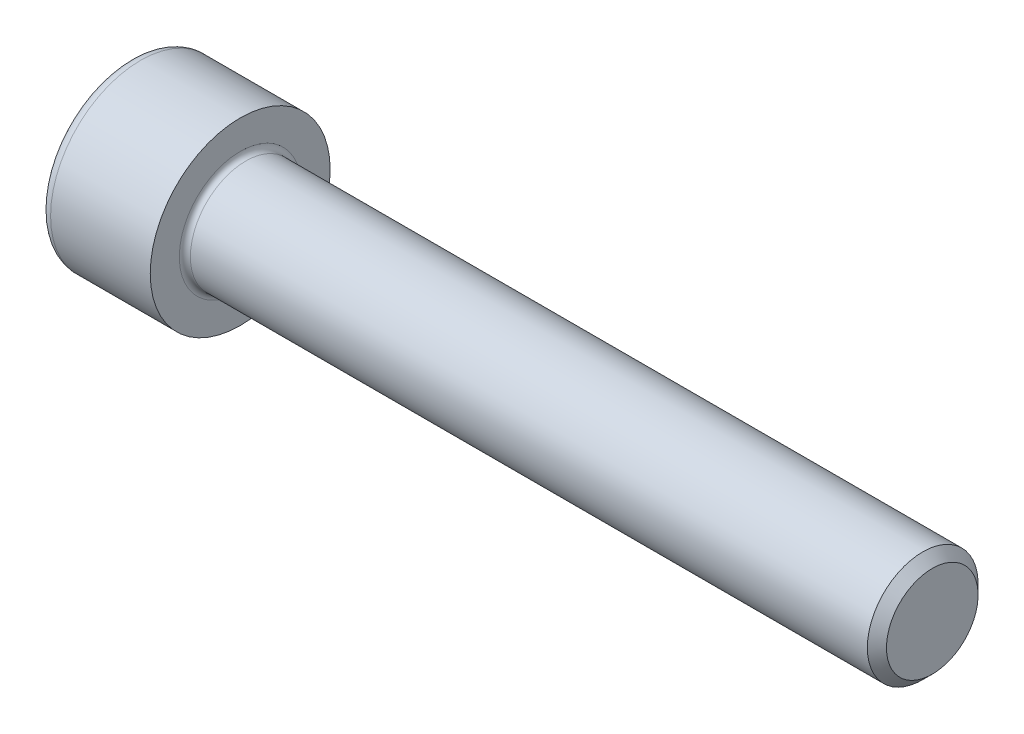
ISO-10303-21;
HEADER;
FILE_DESCRIPTION(('STEP AP214'),'2;1');
FILE_NAME('part.step','',(''),(''),'','','');
FILE_SCHEMA(('AUTOMOTIVE_DESIGN { 1 0 10303 214 1 1 1 1 }'));
ENDSEC;
DATA;
#1=APPLICATION_CONTEXT('core data for automotive mechanical design processes');
#2=APPLICATION_PROTOCOL_DEFINITION('international standard','automotive_design',2000,#1);
#3=PRODUCT_CONTEXT('',#1,'mechanical');
#4=PRODUCT('Part','Part','',(#3));
#5=PRODUCT_RELATED_PRODUCT_CATEGORY('part','',(#4));
#6=PRODUCT_DEFINITION_FORMATION('','',#4);
#7=PRODUCT_DEFINITION_CONTEXT('part definition',#1,'design');
#8=PRODUCT_DEFINITION('design','',#6,#7);
#9=PRODUCT_DEFINITION_SHAPE('','',#8);
#10=(LENGTH_UNIT() NAMED_UNIT(*) SI_UNIT(.MILLI.,.METRE.));
#11=(NAMED_UNIT(*) PLANE_ANGLE_UNIT() SI_UNIT($,.RADIAN.));
#12=(NAMED_UNIT(*) SI_UNIT($,.STERADIAN.) SOLID_ANGLE_UNIT());
#13=UNCERTAINTY_MEASURE_WITH_UNIT(LENGTH_MEASURE(1.E-05),#10,'distance_accuracy_value','');
#14=(GEOMETRIC_REPRESENTATION_CONTEXT(3) GLOBAL_UNCERTAINTY_ASSIGNED_CONTEXT((#13)) GLOBAL_UNIT_ASSIGNED_CONTEXT((#10,
#11,#12)) REPRESENTATION_CONTEXT('',''));
#15=CARTESIAN_POINT('',(0.,0.,0.));
#16=DIRECTION('',(0.,0.,1.));
#17=DIRECTION('',(1.,0.,0.));
#18=AXIS2_PLACEMENT_3D('',#15,#16,#17);
#19=CARTESIAN_POINT('',(0.,0.,0.));
#20=DIRECTION('',(-1.,0.,0.));
#21=DIRECTION('',(0.,0.,1.));
#22=AXIS2_PLACEMENT_3D('',#19,#20,#21);
#23=PLANE('',#22);
#24=DIRECTION('',(0.,-0.499999999999999,0.866025403784439));
#25=VECTOR('',#24,1.);
#26=CARTESIAN_POINT('',(0.,3.47564862052154,0.));
#27=LINE('',#26,#25);
#28=CARTESIAN_POINT('',(0.,3.47564862052154,0.));
#29=VERTEX_POINT('',#28);
#30=CARTESIAN_POINT('',(0.,1.73782431026077,3.01));
#31=VERTEX_POINT('',#30);
#32=EDGE_CURVE('E259',#29,#31,#27,.T.);
#33=ORIENTED_EDGE('',*,*,#32,.T.);
#34=DIRECTION('',(0.,1.,0.));
#35=VECTOR('',#34,1.);
#36=CARTESIAN_POINT('',(0.,-1.73782431026077,3.01));
#37=LINE('',#36,#35);
#38=CARTESIAN_POINT('',(0.,-1.73782431026077,3.01));
#39=VERTEX_POINT('',#38);
#40=EDGE_CURVE('E131',#39,#31,#37,.T.);
#41=ORIENTED_EDGE('',*,*,#40,.F.);
#42=DIRECTION('',(0.,-0.500000000000001,-0.866025403784438));
#43=VECTOR('',#42,1.);
#44=CARTESIAN_POINT('',(0.,-1.73782431026077,3.01));
#45=LINE('',#44,#43);
#46=CARTESIAN_POINT('',(0.,-3.47564862052155,0.));
#47=VERTEX_POINT('',#46);
#48=EDGE_CURVE('E262',#39,#47,#45,.T.);
#49=ORIENTED_EDGE('',*,*,#48,.T.);
#50=DIRECTION('',(0.,0.499999999999999,-0.866025403784439));
#51=VECTOR('',#50,1.);
#52=CARTESIAN_POINT('',(0.,-3.47564862052155,0.));
#53=LINE('',#52,#51);
#54=CARTESIAN_POINT('',(0.,-1.73782431026078,-3.01));
#55=VERTEX_POINT('',#54);
#56=EDGE_CURVE('E265',#47,#55,#53,.T.);
#57=ORIENTED_EDGE('',*,*,#56,.T.);
#58=DIRECTION('',(0.,-1.,0.));
#59=VECTOR('',#58,1.);
#60=CARTESIAN_POINT('',(0.,1.73782431026076,-3.01));
#61=LINE('',#60,#59);
#62=CARTESIAN_POINT('',(0.,1.73782431026076,-3.01));
#63=VERTEX_POINT('',#62);
#64=EDGE_CURVE('E268',#63,#55,#61,.T.);
#65=ORIENTED_EDGE('',*,*,#64,.F.);
#66=DIRECTION('',(0.,-0.500000000000001,-0.866025403784438));
#67=VECTOR('',#66,1.);
#68=CARTESIAN_POINT('',(0.,3.47564862052154,0.));
#69=LINE('',#68,#67);
#70=EDGE_CURVE('E126',#29,#63,#69,.T.);
#71=ORIENTED_EDGE('',*,*,#70,.F.);
#72=EDGE_LOOP('',(#33,#41,#49,#57,#65,#71));
#73=FACE_BOUND('',#72,.T.);
#74=CARTESIAN_POINT('',(0.,0.,0.));
#75=DIRECTION('',(-1.,0.,0.));
#76=DIRECTION('',(0.,0.,1.));
#77=AXIS2_PLACEMENT_3D('',#74,#75,#76);
#78=CIRCLE('',#77,5.7);
#79=CARTESIAN_POINT('',(0.,0.,5.7));
#80=VERTEX_POINT('',#79);
#81=EDGE_CURVE('E43',#80,#80,#78,.T.);
#82=ORIENTED_EDGE('',*,*,#81,.T.);
#83=EDGE_LOOP('',(#82));
#84=FACE_BOUND('',#83,.T.);
#85=ADVANCED_FACE('F35',(#73,#84),#23,.T.);
#86=CARTESIAN_POINT('',(-31.75,0.,0.));
#87=DIRECTION('',(-1.,0.,0.));
#88=DIRECTION('',(0.,0.,1.));
#89=AXIS2_PLACEMENT_3D('',#86,#87,#88);
#90=CYLINDRICAL_SURFACE('',#89,6.5);
#91=CARTESIAN_POINT('',(0.800000000000002,0.,0.));
#92=DIRECTION('',(-1.,0.,0.));
#93=DIRECTION('',(0.,0.,1.));
#94=AXIS2_PLACEMENT_3D('',#91,#92,#93);
#95=CIRCLE('',#94,6.5);
#96=CARTESIAN_POINT('',(0.800000000000002,0.,6.5));
#97=VERTEX_POINT('',#96);
#98=EDGE_CURVE('E11',#97,#97,#95,.F.);
#99=ORIENTED_EDGE('',*,*,#98,.T.);
#100=EDGE_LOOP('',(#99));
#101=FACE_BOUND('',#100,.T.);
#102=CARTESIAN_POINT('',(8.,0.,0.));
#103=DIRECTION('',(-1.,0.,0.));
#104=DIRECTION('',(0.,0.,1.));
#105=AXIS2_PLACEMENT_3D('',#102,#103,#104);
#106=CIRCLE('',#105,6.5);
#107=CARTESIAN_POINT('',(8.,0.,6.5));
#108=VERTEX_POINT('',#107);
#109=EDGE_CURVE('E149',#108,#108,#106,.T.);
#110=ORIENTED_EDGE('',*,*,#109,.T.);
#111=EDGE_LOOP('',(#110));
#112=FACE_BOUND('',#111,.T.);
#113=ADVANCED_FACE('F173',(#101,#112),#90,.T.);
#114=CARTESIAN_POINT('',(8.,6.5,0.));
#115=DIRECTION('',(1.,0.,0.));
#116=DIRECTION('',(0.,0.,-1.));
#117=AXIS2_PLACEMENT_3D('',#114,#115,#116);
#118=PLANE('',#117);
#119=CARTESIAN_POINT('',(8.,0.,0.));
#120=DIRECTION('',(1.,0.,0.));
#121=DIRECTION('',(0.,0.,-1.));
#122=AXIS2_PLACEMENT_3D('',#119,#120,#121);
#123=CIRCLE('',#122,4.39999999999999);
#124=CARTESIAN_POINT('',(8.,0.,-4.39999999999999));
#125=VERTEX_POINT('',#124);
#126=EDGE_CURVE('E152',#125,#125,#123,.F.);
#127=ORIENTED_EDGE('',*,*,#126,.T.);
#128=EDGE_LOOP('',(#127));
#129=FACE_BOUND('',#128,.T.);
#130=ORIENTED_EDGE('',*,*,#109,.F.);
#131=EDGE_LOOP('',(#130));
#132=FACE_BOUND('',#131,.T.);
#133=ADVANCED_FACE('F179',(#129,#132),#118,.T.);
#134=CARTESIAN_POINT('',(-31.75,0.,0.));
#135=DIRECTION('',(-1.,0.,0.));
#136=DIRECTION('',(0.,0.,1.));
#137=AXIS2_PLACEMENT_3D('',#134,#135,#136);
#138=CYLINDRICAL_SURFACE('',#137,3.99999999999999);
#139=CARTESIAN_POINT('',(8.4,0.,0.));
#140=DIRECTION('',(1.,0.,0.));
#141=DIRECTION('',(0.,0.,-1.));
#142=AXIS2_PLACEMENT_3D('',#139,#140,#141);
#143=CIRCLE('',#142,3.99999999999999);
#144=CARTESIAN_POINT('',(8.4,0.,-3.99999999999999));
#145=VERTEX_POINT('',#144);
#146=EDGE_CURVE('E155',#145,#145,#143,.T.);
#147=ORIENTED_EDGE('',*,*,#146,.T.);
#148=EDGE_LOOP('',(#147));
#149=FACE_BOUND('',#148,.T.);
#150=CARTESIAN_POINT('',(57.3095,0.,0.));
#151=DIRECTION('',(-1.,0.,0.));
#152=DIRECTION('',(0.,0.,1.));
#153=AXIS2_PLACEMENT_3D('',#150,#151,#152);
#154=CIRCLE('',#153,3.99999999999998);
#155=CARTESIAN_POINT('',(57.3095,0.,3.99999999999998));
#156=VERTEX_POINT('',#155);
#157=EDGE_CURVE('E146',#156,#156,#154,.T.);
#158=ORIENTED_EDGE('',*,*,#157,.T.);
#159=EDGE_LOOP('',(#158));
#160=FACE_BOUND('',#159,.T.);
#161=ADVANCED_FACE('F185',(#149,#160),#138,.T.);
#162=CARTESIAN_POINT('',(58.,0.,0.));
#163=DIRECTION('',(-1.,0.,0.));
#164=DIRECTION('',(0.,0.,1.));
#165=AXIS2_PLACEMENT_3D('',#162,#163,#164);
#166=CONICAL_SURFACE('',#165,3.3095,0.785398163397423);
#167=ORIENTED_EDGE('',*,*,#157,.F.);
#168=EDGE_LOOP('',(#167));
#169=FACE_BOUND('',#168,.T.);
#170=CARTESIAN_POINT('',(58.,0.,0.));
#171=DIRECTION('',(-1.,0.,0.));
#172=DIRECTION('',(0.,0.,1.));
#173=AXIS2_PLACEMENT_3D('',#170,#171,#172);
#174=CIRCLE('',#173,3.3095);
#175=CARTESIAN_POINT('',(58.,0.,3.3095));
#176=VERTEX_POINT('',#175);
#177=EDGE_CURVE('E142',#176,#176,#174,.T.);
#178=ORIENTED_EDGE('',*,*,#177,.T.);
#179=EDGE_LOOP('',(#178));
#180=FACE_BOUND('',#179,.T.);
#181=ADVANCED_FACE('F189',(#169,#180),#166,.T.);
#182=CARTESIAN_POINT('',(58.,3.3095,0.));
#183=DIRECTION('',(1.,0.,0.));
#184=DIRECTION('',(0.,0.,-1.));
#185=AXIS2_PLACEMENT_3D('',#182,#183,#184);
#186=PLANE('',#185);
#187=ORIENTED_EDGE('',*,*,#177,.F.);
#188=EDGE_LOOP('',(#187));
#189=FACE_BOUND('',#188,.T.);
#190=ADVANCED_FACE('F169',(#189),#186,.T.);
#191=CARTESIAN_POINT('',(8.4,0.,0.));
#192=DIRECTION('',(1.,0.,0.));
#193=DIRECTION('',(0.,0.,-1.));
#194=AXIS2_PLACEMENT_3D('',#191,#192,#193);
#195=TOROIDAL_SURFACE('',#194,4.39999999999999,0.4);
#196=ORIENTED_EDGE('',*,*,#146,.F.);
#197=EDGE_LOOP('',(#196));
#198=FACE_BOUND('',#197,.T.);
#199=ORIENTED_EDGE('',*,*,#126,.F.);
#200=EDGE_LOOP('',(#199));
#201=FACE_BOUND('',#200,.T.);
#202=ADVANCED_FACE('F162',(#198,#201),#195,.F.);
#203=CARTESIAN_POINT('',(0.800000000000002,0.,0.));
#204=DIRECTION('',(-1.,0.,0.));
#205=DIRECTION('',(0.,0.,1.));
#206=AXIS2_PLACEMENT_3D('',#203,#204,#205);
#207=TOROIDAL_SURFACE('',#206,5.7,0.8);
#208=ORIENTED_EDGE('',*,*,#98,.F.);
#209=EDGE_LOOP('',(#208));
#210=FACE_BOUND('',#209,.T.);
#211=ORIENTED_EDGE('',*,*,#81,.F.);
#212=EDGE_LOOP('',(#211));
#213=FACE_BOUND('',#212,.T.);
#214=ADVANCED_FACE('F37',(#210,#213),#207,.T.);
#215=CARTESIAN_POINT('',(4.,3.47564862052154,0.));
#216=DIRECTION('',(0.,-0.866025403784439,-0.499999999999999));
#217=DIRECTION('',(0.,0.499999999999999,-0.866025403784439));
#218=AXIS2_PLACEMENT_3D('',#215,#216,#217);
#219=PLANE('',#218);
#220=ORIENTED_EDGE('',*,*,#32,.F.);
#221=DIRECTION('',(-1.,0.,0.));
#222=VECTOR('',#221,1.);
#223=CARTESIAN_POINT('',(4.,3.47564862052154,0.));
#224=LINE('',#223,#222);
#225=CARTESIAN_POINT('',(4.,3.47564862052154,0.));
#226=VERTEX_POINT('',#225);
#227=EDGE_CURVE('E249',#226,#29,#224,.T.);
#228=ORIENTED_EDGE('',*,*,#227,.F.);
#229=DIRECTION('',(0.,-0.499999999999999,0.866025403784439));
#230=VECTOR('',#229,1.);
#231=CARTESIAN_POINT('',(4.,3.47564862052154,0.));
#232=LINE('',#231,#230);
#233=CARTESIAN_POINT('',(4.,2.60673646539116,1.50499999999999));
#234=VERTEX_POINT('',#233);
#235=EDGE_CURVE('E118',#226,#234,#232,.T.);
#236=ORIENTED_EDGE('',*,*,#235,.T.);
#237=CARTESIAN_POINT('',(4.,1.73782431026077,3.01));
#238=VERTEX_POINT('',#237);
#239=EDGE_CURVE('E109',#234,#238,#232,.T.);
#240=ORIENTED_EDGE('',*,*,#239,.T.);
#241=DIRECTION('',(-1.,0.,0.));
#242=VECTOR('',#241,1.);
#243=CARTESIAN_POINT('',(4.,1.73782431026077,3.01));
#244=LINE('',#243,#242);
#245=EDGE_CURVE('E123',#238,#31,#244,.T.);
#246=ORIENTED_EDGE('',*,*,#245,.T.);
#247=EDGE_LOOP('',(#220,#228,#236,#240,#246));
#248=FACE_BOUND('',#247,.T.);
#249=ADVANCED_FACE('F122',(#248),#219,.T.);
#250=CARTESIAN_POINT('',(4.,-1.73782431026077,3.01));
#251=DIRECTION('',(0.,0.,1.));
#252=DIRECTION('',(0.,-1.,0.));
#253=AXIS2_PLACEMENT_3D('',#250,#251,#252);
#254=PLANE('',#253);
#255=ORIENTED_EDGE('',*,*,#40,.T.);
#256=ORIENTED_EDGE('',*,*,#245,.F.);
#257=DIRECTION('',(0.,1.,0.));
#258=VECTOR('',#257,1.);
#259=CARTESIAN_POINT('',(4.,-1.73782431026077,3.01));
#260=LINE('',#259,#258);
#261=CARTESIAN_POINT('',(4.,0.,3.01));
#262=VERTEX_POINT('',#261);
#263=EDGE_CURVE('E106',#262,#238,#260,.T.);
#264=ORIENTED_EDGE('',*,*,#263,.F.);
#265=CARTESIAN_POINT('',(4.,-1.73782431026077,3.01));
#266=VERTEX_POINT('',#265);
#267=EDGE_CURVE('E117',#266,#262,#260,.T.);
#268=ORIENTED_EDGE('',*,*,#267,.F.);
#269=DIRECTION('',(-1.,0.,0.));
#270=VECTOR('',#269,1.);
#271=CARTESIAN_POINT('',(4.,-1.73782431026077,3.01));
#272=LINE('',#271,#270);
#273=EDGE_CURVE('E133',#266,#39,#272,.T.);
#274=ORIENTED_EDGE('',*,*,#273,.T.);
#275=EDGE_LOOP('',(#255,#256,#264,#268,#274));
#276=FACE_BOUND('',#275,.T.);
#277=ADVANCED_FACE('F128',(#276),#254,.F.);
#278=CARTESIAN_POINT('',(4.,-1.73782431026077,3.01));
#279=DIRECTION('',(0.,0.866025403784438,-0.500000000000001));
#280=DIRECTION('',(0.,0.500000000000001,0.866025403784438));
#281=AXIS2_PLACEMENT_3D('',#278,#279,#280);
#282=PLANE('',#281);
#283=ORIENTED_EDGE('',*,*,#48,.F.);
#284=ORIENTED_EDGE('',*,*,#273,.F.);
#285=DIRECTION('',(0.,-0.500000000000001,-0.866025403784438));
#286=VECTOR('',#285,1.);
#287=CARTESIAN_POINT('',(4.,-1.73782431026077,3.01));
#288=LINE('',#287,#286);
#289=CARTESIAN_POINT('',(4.,-2.60673646539116,1.505));
#290=VERTEX_POINT('',#289);
#291=EDGE_CURVE('E288',#266,#290,#288,.T.);
#292=ORIENTED_EDGE('',*,*,#291,.T.);
#293=CARTESIAN_POINT('',(4.,-3.47564862052155,0.));
#294=VERTEX_POINT('',#293);
#295=EDGE_CURVE('E277',#290,#294,#288,.T.);
#296=ORIENTED_EDGE('',*,*,#295,.T.);
#297=DIRECTION('',(-1.,0.,0.));
#298=VECTOR('',#297,1.);
#299=CARTESIAN_POINT('',(4.,-3.47564862052155,0.));
#300=LINE('',#299,#298);
#301=EDGE_CURVE('E138',#294,#47,#300,.T.);
#302=ORIENTED_EDGE('',*,*,#301,.T.);
#303=EDGE_LOOP('',(#283,#284,#292,#296,#302));
#304=FACE_BOUND('',#303,.T.);
#305=ADVANCED_FACE('F203',(#304),#282,.T.);
#306=CARTESIAN_POINT('',(4.,-3.47564862052155,0.));
#307=DIRECTION('',(0.,0.866025403784439,0.499999999999999));
#308=DIRECTION('',(0.,-0.499999999999999,0.866025403784439));
#309=AXIS2_PLACEMENT_3D('',#306,#307,#308);
#310=PLANE('',#309);
#311=ORIENTED_EDGE('',*,*,#56,.F.);
#312=ORIENTED_EDGE('',*,*,#301,.F.);
#313=DIRECTION('',(0.,0.499999999999999,-0.866025403784439));
#314=VECTOR('',#313,1.);
#315=CARTESIAN_POINT('',(4.,-3.47564862052155,0.));
#316=LINE('',#315,#314);
#317=CARTESIAN_POINT('',(4.,-2.60673646539117,-1.505));
#318=VERTEX_POINT('',#317);
#319=EDGE_CURVE('E255',#294,#318,#316,.T.);
#320=ORIENTED_EDGE('',*,*,#319,.T.);
#321=CARTESIAN_POINT('',(4.,-1.73782431026078,-3.01));
#322=VERTEX_POINT('',#321);
#323=EDGE_CURVE('E287',#318,#322,#316,.T.);
#324=ORIENTED_EDGE('',*,*,#323,.T.);
#325=DIRECTION('',(-1.,0.,0.));
#326=VECTOR('',#325,1.);
#327=CARTESIAN_POINT('',(4.,-1.73782431026078,-3.01));
#328=LINE('',#327,#326);
#329=EDGE_CURVE('E248',#322,#55,#328,.T.);
#330=ORIENTED_EDGE('',*,*,#329,.T.);
#331=EDGE_LOOP('',(#311,#312,#320,#324,#330));
#332=FACE_BOUND('',#331,.T.);
#333=ADVANCED_FACE('F206',(#332),#310,.T.);
#334=CARTESIAN_POINT('',(4.,1.73782431026076,-3.01));
#335=DIRECTION('',(0.,0.,-1.));
#336=DIRECTION('',(0.,1.,0.));
#337=AXIS2_PLACEMENT_3D('',#334,#335,#336);
#338=PLANE('',#337);
#339=ORIENTED_EDGE('',*,*,#64,.T.);
#340=ORIENTED_EDGE('',*,*,#329,.F.);
#341=DIRECTION('',(0.,-1.,0.));
#342=VECTOR('',#341,1.);
#343=CARTESIAN_POINT('',(4.,1.73782431026076,-3.01));
#344=LINE('',#343,#342);
#345=CARTESIAN_POINT('',(4.,0.,-3.01));
#346=VERTEX_POINT('',#345);
#347=EDGE_CURVE('E252',#346,#322,#344,.T.);
#348=ORIENTED_EDGE('',*,*,#347,.F.);
#349=CARTESIAN_POINT('',(4.,1.73782431026076,-3.01));
#350=VERTEX_POINT('',#349);
#351=EDGE_CURVE('E50',#350,#346,#344,.T.);
#352=ORIENTED_EDGE('',*,*,#351,.F.);
#353=DIRECTION('',(-1.,0.,0.));
#354=VECTOR('',#353,1.);
#355=CARTESIAN_POINT('',(4.,1.73782431026076,-3.01));
#356=LINE('',#355,#354);
#357=EDGE_CURVE('E245',#350,#63,#356,.T.);
#358=ORIENTED_EDGE('',*,*,#357,.T.);
#359=EDGE_LOOP('',(#339,#340,#348,#352,#358));
#360=FACE_BOUND('',#359,.T.);
#361=ADVANCED_FACE('F210',(#360),#338,.F.);
#362=CARTESIAN_POINT('',(4.,3.47564862052154,0.));
#363=DIRECTION('',(0.,0.866025403784438,-0.500000000000001));
#364=DIRECTION('',(0.,0.500000000000001,0.866025403784438));
#365=AXIS2_PLACEMENT_3D('',#362,#363,#364);
#366=PLANE('',#365);
#367=ORIENTED_EDGE('',*,*,#70,.T.);
#368=ORIENTED_EDGE('',*,*,#357,.F.);
#369=DIRECTION('',(0.,-0.500000000000001,-0.866025403784438));
#370=VECTOR('',#369,1.);
#371=CARTESIAN_POINT('',(4.,3.47564862052154,0.));
#372=LINE('',#371,#370);
#373=CARTESIAN_POINT('',(4.,2.60673646539115,-1.505));
#374=VERTEX_POINT('',#373);
#375=EDGE_CURVE('E235',#374,#350,#372,.T.);
#376=ORIENTED_EDGE('',*,*,#375,.F.);
#377=EDGE_CURVE('E241',#226,#374,#372,.T.);
#378=ORIENTED_EDGE('',*,*,#377,.F.);
#379=ORIENTED_EDGE('',*,*,#227,.T.);
#380=EDGE_LOOP('',(#367,#368,#376,#378,#379));
#381=FACE_BOUND('',#380,.T.);
#382=ADVANCED_FACE('F214',(#381),#366,.F.);
#383=CARTESIAN_POINT('',(4.,5.21347293078231,-3.01000000000001));
#384=DIRECTION('',(1.,0.,0.));
#385=DIRECTION('',(0.,0.,-1.));
#386=AXIS2_PLACEMENT_3D('',#383,#384,#385);
#387=PLANE('',#386);
#388=ORIENTED_EDGE('',*,*,#347,.T.);
#389=ORIENTED_EDGE('',*,*,#323,.F.);
#390=CARTESIAN_POINT('',(4.,0.,0.));
#391=DIRECTION('',(-1.,0.,0.));
#392=DIRECTION('',(0.,0.,1.));
#393=AXIS2_PLACEMENT_3D('',#390,#391,#392);
#394=CIRCLE('',#393,3.01);
#395=EDGE_CURVE('E283',#346,#318,#394,.T.);
#396=ORIENTED_EDGE('',*,*,#395,.F.);
#397=EDGE_LOOP('',(#388,#389,#396));
#398=FACE_BOUND('',#397,.T.);
#399=ADVANCED_FACE('F218',(#398),#387,.F.);
#400=ORIENTED_EDGE('',*,*,#319,.F.);
#401=ORIENTED_EDGE('',*,*,#295,.F.);
#402=EDGE_CURVE('E136',#318,#290,#394,.T.);
#403=ORIENTED_EDGE('',*,*,#402,.F.);
#404=EDGE_LOOP('',(#400,#401,#403));
#405=FACE_BOUND('',#404,.T.);
#406=ADVANCED_FACE('F221',(#405),#387,.F.);
#407=ORIENTED_EDGE('',*,*,#291,.F.);
#408=ORIENTED_EDGE('',*,*,#267,.T.);
#409=EDGE_CURVE('E132',#290,#262,#394,.T.);
#410=ORIENTED_EDGE('',*,*,#409,.F.);
#411=EDGE_LOOP('',(#407,#408,#410));
#412=FACE_BOUND('',#411,.T.);
#413=ADVANCED_FACE('F226',(#412),#387,.F.);
#414=ORIENTED_EDGE('',*,*,#263,.T.);
#415=ORIENTED_EDGE('',*,*,#239,.F.);
#416=EDGE_CURVE('E112',#262,#234,#394,.T.);
#417=ORIENTED_EDGE('',*,*,#416,.F.);
#418=EDGE_LOOP('',(#414,#415,#417));
#419=FACE_BOUND('',#418,.T.);
#420=ADVANCED_FACE('F108',(#419),#387,.F.);
#421=ORIENTED_EDGE('',*,*,#235,.F.);
#422=ORIENTED_EDGE('',*,*,#377,.T.);
#423=EDGE_CURVE('E143',#234,#374,#394,.T.);
#424=ORIENTED_EDGE('',*,*,#423,.F.);
#425=EDGE_LOOP('',(#421,#422,#424));
#426=FACE_BOUND('',#425,.T.);
#427=ADVANCED_FACE('F229',(#426),#387,.F.);
#428=ORIENTED_EDGE('',*,*,#375,.T.);
#429=ORIENTED_EDGE('',*,*,#351,.T.);
#430=EDGE_CURVE('E238',#374,#346,#394,.T.);
#431=ORIENTED_EDGE('',*,*,#430,.F.);
#432=EDGE_LOOP('',(#428,#429,#431));
#433=FACE_BOUND('',#432,.T.);
#434=ADVANCED_FACE('F199',(#433),#387,.F.);
#435=CARTESIAN_POINT('',(4.,0.,0.));
#436=DIRECTION('',(-1.,0.,0.));
#437=DIRECTION('',(0.,0.,1.));
#438=AXIS2_PLACEMENT_3D('',#435,#436,#437);
#439=CONICAL_SURFACE('',#438,3.01,1.04719755119659);
#440=CARTESIAN_POINT('',(5.73782431026079,0.,0.));
#441=VERTEX_POINT('',#440);
#442=VERTEX_LOOP('',#441);
#443=FACE_BOUND('',#442,.T.);
#444=ORIENTED_EDGE('',*,*,#416,.T.);
#445=ORIENTED_EDGE('',*,*,#423,.T.);
#446=ORIENTED_EDGE('',*,*,#430,.T.);
#447=ORIENTED_EDGE('',*,*,#395,.T.);
#448=ORIENTED_EDGE('',*,*,#402,.T.);
#449=ORIENTED_EDGE('',*,*,#409,.T.);
#450=EDGE_LOOP('',(#444,#445,#446,#447,#448,#449));
#451=FACE_BOUND('',#450,.T.);
#452=ADVANCED_FACE('F197',(#443,#451),#439,.F.);
#453=CLOSED_SHELL('',(#85,#113,#133,#161,#181,#190,#202,#214,#249,#277,#305,#333,#361,#382,#399,
#406,#413,#420,#427,#434,#452));
#454=MANIFOLD_SOLID_BREP('B2',#453);
#455=ADVANCED_BREP_SHAPE_REPRESENTATION('',(#18,#454),#14);
#456=SHAPE_DEFINITION_REPRESENTATION(#9,#455);
ENDSEC;
END-ISO-10303-21;
